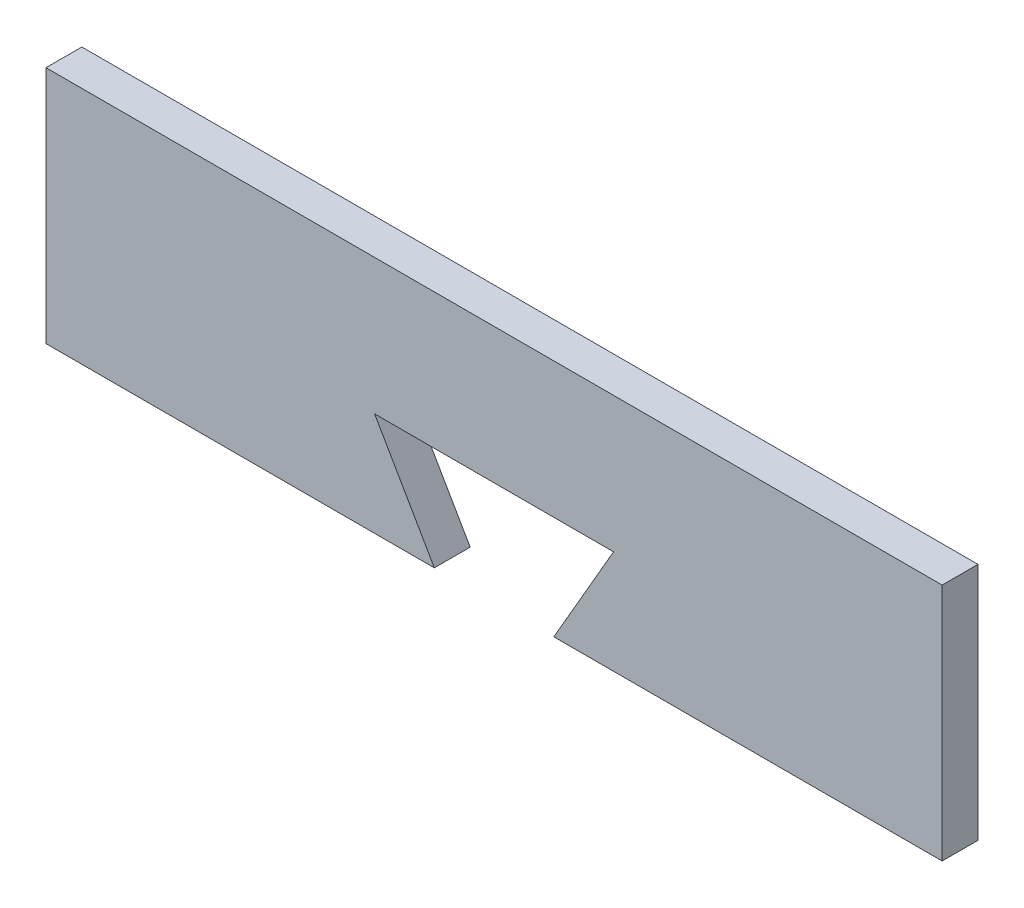
ISO-10303-21;
HEADER;
FILE_DESCRIPTION(('STEP AP214'),'2;1');
FILE_NAME('part.step','',(''),(''),'','','');
FILE_SCHEMA(('AUTOMOTIVE_DESIGN { 1 0 10303 214 1 1 1 1 }'));
ENDSEC;
DATA;
#1=APPLICATION_CONTEXT('core data for automotive mechanical design processes');
#2=APPLICATION_PROTOCOL_DEFINITION('international standard','automotive_design',2000,#1);
#3=PRODUCT_CONTEXT('',#1,'mechanical');
#4=PRODUCT('Part','Part','',(#3));
#5=PRODUCT_RELATED_PRODUCT_CATEGORY('part','',(#4));
#6=PRODUCT_DEFINITION_FORMATION('','',#4);
#7=PRODUCT_DEFINITION_CONTEXT('part definition',#1,'design');
#8=PRODUCT_DEFINITION('design','',#6,#7);
#9=PRODUCT_DEFINITION_SHAPE('','',#8);
#10=(LENGTH_UNIT() NAMED_UNIT(*) SI_UNIT(.MILLI.,.METRE.));
#11=(NAMED_UNIT(*) PLANE_ANGLE_UNIT() SI_UNIT($,.RADIAN.));
#12=(NAMED_UNIT(*) SI_UNIT($,.STERADIAN.) SOLID_ANGLE_UNIT());
#13=UNCERTAINTY_MEASURE_WITH_UNIT(LENGTH_MEASURE(1.E-05),#10,'distance_accuracy_value','');
#14=(GEOMETRIC_REPRESENTATION_CONTEXT(3) GLOBAL_UNCERTAINTY_ASSIGNED_CONTEXT((#13)) GLOBAL_UNIT_ASSIGNED_CONTEXT((#10,
#11,#12)) REPRESENTATION_CONTEXT('',''));
#15=CARTESIAN_POINT('',(0.,0.,0.));
#16=DIRECTION('',(0.,0.,1.));
#17=DIRECTION('',(1.,0.,0.));
#18=AXIS2_PLACEMENT_3D('',#15,#16,#17);
#19=CARTESIAN_POINT('',(-84.8349325818649,-10.8778625954199,6.));
#20=DIRECTION('',(1.,0.,0.));
#21=DIRECTION('',(0.,1.,0.));
#22=AXIS2_PLACEMENT_3D('',#19,#20,#21);
#23=PLANE('',#22);
#24=DIRECTION('',(0.,-1.,0.));
#25=VECTOR('',#24,1.);
#26=CARTESIAN_POINT('',(-84.8349325818649,-10.8778625954199,0.));
#27=LINE('',#26,#25);
#28=CARTESIAN_POINT('',(-84.8349325818649,29.1221374045802,0.));
#29=VERTEX_POINT('',#28);
#30=CARTESIAN_POINT('',(-84.8349325818649,-10.8778625954199,0.));
#31=VERTEX_POINT('',#30);
#32=EDGE_CURVE('E128',#29,#31,#27,.T.);
#33=ORIENTED_EDGE('',*,*,#32,.T.);
#34=DIRECTION('',(0.,0.,-1.));
#35=VECTOR('',#34,1.);
#36=CARTESIAN_POINT('',(-84.8349325818649,-10.8778625954199,6.));
#37=LINE('',#36,#35);
#38=CARTESIAN_POINT('',(-84.8349325818649,-10.8778625954199,6.));
#39=VERTEX_POINT('',#38);
#40=EDGE_CURVE('E11',#39,#31,#37,.T.);
#41=ORIENTED_EDGE('',*,*,#40,.F.);
#42=DIRECTION('',(0.,-1.,0.));
#43=VECTOR('',#42,1.);
#44=CARTESIAN_POINT('',(-84.8349325818649,-10.8778625954199,6.));
#45=LINE('',#44,#43);
#46=CARTESIAN_POINT('',(-84.8349325818649,29.1221374045802,6.));
#47=VERTEX_POINT('',#46);
#48=EDGE_CURVE('E142',#47,#39,#45,.T.);
#49=ORIENTED_EDGE('',*,*,#48,.F.);
#50=DIRECTION('',(0.,0.,-1.));
#51=VECTOR('',#50,1.);
#52=CARTESIAN_POINT('',(-84.8349325818649,29.1221374045802,6.));
#53=LINE('',#52,#51);
#54=EDGE_CURVE('E124',#47,#29,#53,.T.);
#55=ORIENTED_EDGE('',*,*,#54,.T.);
#56=EDGE_LOOP('',(#33,#41,#49,#55));
#57=FACE_BOUND('',#56,.T.);
#58=ADVANCED_FACE('F32',(#57),#23,.F.);
#59=CARTESIAN_POINT('',(-19.8349325818649,-10.8778625954198,6.));
#60=DIRECTION('',(0.,1.,0.));
#61=DIRECTION('',(-1.,0.,0.));
#62=AXIS2_PLACEMENT_3D('',#59,#60,#61);
#63=PLANE('',#62);
#64=DIRECTION('',(1.,0.,0.));
#65=VECTOR('',#64,1.);
#66=CARTESIAN_POINT('',(-19.8349325818649,-10.8778625954198,0.));
#67=LINE('',#66,#65);
#68=CARTESIAN_POINT('',(-19.8349325818649,-10.8778625954198,0.));
#69=VERTEX_POINT('',#68);
#70=EDGE_CURVE('E131',#31,#69,#67,.T.);
#71=ORIENTED_EDGE('',*,*,#70,.T.);
#72=DIRECTION('',(0.,0.,-1.));
#73=VECTOR('',#72,1.);
#74=CARTESIAN_POINT('',(-19.8349325818649,-10.8778625954198,6.));
#75=LINE('',#74,#73);
#76=CARTESIAN_POINT('',(-19.8349325818649,-10.8778625954198,6.));
#77=VERTEX_POINT('',#76);
#78=EDGE_CURVE('E40',#77,#69,#75,.T.);
#79=ORIENTED_EDGE('',*,*,#78,.F.);
#80=DIRECTION('',(1.,0.,0.));
#81=VECTOR('',#80,1.);
#82=CARTESIAN_POINT('',(-19.8349325818649,-10.8778625954198,6.));
#83=LINE('',#82,#81);
#84=EDGE_CURVE('E91',#39,#77,#83,.T.);
#85=ORIENTED_EDGE('',*,*,#84,.F.);
#86=ORIENTED_EDGE('',*,*,#40,.T.);
#87=EDGE_LOOP('',(#71,#79,#85,#86));
#88=FACE_BOUND('',#87,.T.);
#89=ADVANCED_FACE('F177',(#88),#63,.F.);
#90=CARTESIAN_POINT('',(-29.8349325818649,6.44264548026892,6.));
#91=DIRECTION('',(-0.866025403784438,-0.500000000000001,0.));
#92=DIRECTION('',(0.500000000000001,-0.866025403784438,0.));
#93=AXIS2_PLACEMENT_3D('',#90,#91,#92);
#94=PLANE('',#93);
#95=DIRECTION('',(-0.500000000000001,0.866025403784438,0.));
#96=VECTOR('',#95,1.);
#97=CARTESIAN_POINT('',(-29.8349325818649,6.44264548026892,0.));
#98=LINE('',#97,#96);
#99=CARTESIAN_POINT('',(-29.8349325818649,6.44264548026892,0.));
#100=VERTEX_POINT('',#99);
#101=EDGE_CURVE('E133',#69,#100,#98,.T.);
#102=ORIENTED_EDGE('',*,*,#101,.T.);
#103=DIRECTION('',(0.,0.,-1.));
#104=VECTOR('',#103,1.);
#105=CARTESIAN_POINT('',(-29.8349325818649,6.44264548026892,6.));
#106=LINE('',#105,#104);
#107=CARTESIAN_POINT('',(-29.8349325818649,6.44264548026892,6.));
#108=VERTEX_POINT('',#107);
#109=EDGE_CURVE('E149',#108,#100,#106,.T.);
#110=ORIENTED_EDGE('',*,*,#109,.F.);
#111=DIRECTION('',(-0.500000000000001,0.866025403784438,0.));
#112=VECTOR('',#111,1.);
#113=CARTESIAN_POINT('',(-29.8349325818649,6.44264548026892,6.));
#114=LINE('',#113,#112);
#115=EDGE_CURVE('E157',#77,#108,#114,.T.);
#116=ORIENTED_EDGE('',*,*,#115,.F.);
#117=ORIENTED_EDGE('',*,*,#78,.T.);
#118=EDGE_LOOP('',(#102,#110,#116,#117));
#119=FACE_BOUND('',#118,.T.);
#120=ADVANCED_FACE('F155',(#119),#94,.F.);
#121=CARTESIAN_POINT('',(10.1650674181351,6.44264548026893,6.));
#122=DIRECTION('',(0.,1.,0.));
#123=DIRECTION('',(-1.,0.,0.));
#124=AXIS2_PLACEMENT_3D('',#121,#122,#123);
#125=PLANE('',#124);
#126=DIRECTION('',(1.,0.,0.));
#127=VECTOR('',#126,1.);
#128=CARTESIAN_POINT('',(10.1650674181351,6.44264548026893,0.));
#129=LINE('',#128,#127);
#130=CARTESIAN_POINT('',(10.1650674181351,6.44264548026893,0.));
#131=VERTEX_POINT('',#130);
#132=EDGE_CURVE('E135',#100,#131,#129,.T.);
#133=ORIENTED_EDGE('',*,*,#132,.T.);
#134=DIRECTION('',(0.,0.,-1.));
#135=VECTOR('',#134,1.);
#136=CARTESIAN_POINT('',(10.1650674181351,6.44264548026893,6.));
#137=LINE('',#136,#135);
#138=CARTESIAN_POINT('',(10.1650674181351,6.44264548026893,6.));
#139=VERTEX_POINT('',#138);
#140=EDGE_CURVE('E146',#139,#131,#137,.T.);
#141=ORIENTED_EDGE('',*,*,#140,.F.);
#142=DIRECTION('',(1.,0.,0.));
#143=VECTOR('',#142,1.);
#144=CARTESIAN_POINT('',(10.1650674181351,6.44264548026893,6.));
#145=LINE('',#144,#143);
#146=EDGE_CURVE('E169',#108,#139,#145,.T.);
#147=ORIENTED_EDGE('',*,*,#146,.F.);
#148=ORIENTED_EDGE('',*,*,#109,.T.);
#149=EDGE_LOOP('',(#133,#141,#147,#148));
#150=FACE_BOUND('',#149,.T.);
#151=ADVANCED_FACE('F165',(#150),#125,.F.);
#152=CARTESIAN_POINT('',(0.165067418135101,-10.8778625954199,6.));
#153=DIRECTION('',(0.866025403784439,-0.499999999999999,0.));
#154=DIRECTION('',(0.499999999999999,0.866025403784439,0.));
#155=AXIS2_PLACEMENT_3D('',#152,#153,#154);
#156=PLANE('',#155);
#157=DIRECTION('',(-0.499999999999999,-0.866025403784439,0.));
#158=VECTOR('',#157,1.);
#159=CARTESIAN_POINT('',(0.165067418135101,-10.8778625954199,0.));
#160=LINE('',#159,#158);
#161=CARTESIAN_POINT('',(0.165067418135101,-10.8778625954199,0.));
#162=VERTEX_POINT('',#161);
#163=EDGE_CURVE('E137',#131,#162,#160,.T.);
#164=ORIENTED_EDGE('',*,*,#163,.T.);
#165=DIRECTION('',(0.,0.,-1.));
#166=VECTOR('',#165,1.);
#167=CARTESIAN_POINT('',(0.165067418135101,-10.8778625954199,6.));
#168=LINE('',#167,#166);
#169=CARTESIAN_POINT('',(0.165067418135101,-10.8778625954199,6.));
#170=VERTEX_POINT('',#169);
#171=EDGE_CURVE('E119',#170,#162,#168,.T.);
#172=ORIENTED_EDGE('',*,*,#171,.F.);
#173=DIRECTION('',(-0.499999999999999,-0.866025403784439,0.));
#174=VECTOR('',#173,1.);
#175=CARTESIAN_POINT('',(0.165067418135101,-10.8778625954199,6.));
#176=LINE('',#175,#174);
#177=EDGE_CURVE('E110',#139,#170,#176,.T.);
#178=ORIENTED_EDGE('',*,*,#177,.F.);
#179=ORIENTED_EDGE('',*,*,#140,.T.);
#180=EDGE_LOOP('',(#164,#172,#178,#179));
#181=FACE_BOUND('',#180,.T.);
#182=ADVANCED_FACE('F168',(#181),#156,.F.);
#183=CARTESIAN_POINT('',(65.1650674181351,-10.8778625954198,6.));
#184=DIRECTION('',(0.,1.,0.));
#185=DIRECTION('',(-1.,0.,0.));
#186=AXIS2_PLACEMENT_3D('',#183,#184,#185);
#187=PLANE('',#186);
#188=DIRECTION('',(1.,0.,0.));
#189=VECTOR('',#188,1.);
#190=CARTESIAN_POINT('',(65.1650674181351,-10.8778625954198,0.));
#191=LINE('',#190,#189);
#192=CARTESIAN_POINT('',(65.1650674181351,-10.8778625954198,0.));
#193=VERTEX_POINT('',#192);
#194=EDGE_CURVE('E118',#162,#193,#191,.T.);
#195=ORIENTED_EDGE('',*,*,#194,.T.);
#196=DIRECTION('',(0.,0.,-1.));
#197=VECTOR('',#196,1.);
#198=CARTESIAN_POINT('',(65.1650674181351,-10.8778625954198,6.));
#199=LINE('',#198,#197);
#200=CARTESIAN_POINT('',(65.1650674181351,-10.8778625954198,6.));
#201=VERTEX_POINT('',#200);
#202=EDGE_CURVE('E115',#201,#193,#199,.T.);
#203=ORIENTED_EDGE('',*,*,#202,.F.);
#204=DIRECTION('',(1.,0.,0.));
#205=VECTOR('',#204,1.);
#206=CARTESIAN_POINT('',(65.1650674181351,-10.8778625954198,6.));
#207=LINE('',#206,#205);
#208=EDGE_CURVE('E104',#170,#201,#207,.T.);
#209=ORIENTED_EDGE('',*,*,#208,.F.);
#210=ORIENTED_EDGE('',*,*,#171,.T.);
#211=EDGE_LOOP('',(#195,#203,#209,#210));
#212=FACE_BOUND('',#211,.T.);
#213=ADVANCED_FACE('F116',(#212),#187,.F.);
#214=CARTESIAN_POINT('',(65.1650674181351,29.1221374045802,6.));
#215=DIRECTION('',(-1.,0.,0.));
#216=DIRECTION('',(0.,0.,1.));
#217=AXIS2_PLACEMENT_3D('',#214,#215,#216);
#218=PLANE('',#217);
#219=DIRECTION('',(0.,1.,0.));
#220=VECTOR('',#219,1.);
#221=CARTESIAN_POINT('',(65.1650674181351,29.1221374045802,0.));
#222=LINE('',#221,#220);
#223=CARTESIAN_POINT('',(65.1650674181351,29.1221374045802,0.));
#224=VERTEX_POINT('',#223);
#225=EDGE_CURVE('E77',#193,#224,#222,.T.);
#226=ORIENTED_EDGE('',*,*,#225,.T.);
#227=DIRECTION('',(0.,0.,-1.));
#228=VECTOR('',#227,1.);
#229=CARTESIAN_POINT('',(65.1650674181351,29.1221374045802,6.));
#230=LINE('',#229,#228);
#231=CARTESIAN_POINT('',(65.1650674181351,29.1221374045802,6.));
#232=VERTEX_POINT('',#231);
#233=EDGE_CURVE('E120',#232,#224,#230,.T.);
#234=ORIENTED_EDGE('',*,*,#233,.F.);
#235=DIRECTION('',(0.,1.,0.));
#236=VECTOR('',#235,1.);
#237=CARTESIAN_POINT('',(65.1650674181351,29.1221374045802,6.));
#238=LINE('',#237,#236);
#239=EDGE_CURVE('E108',#201,#232,#238,.T.);
#240=ORIENTED_EDGE('',*,*,#239,.F.);
#241=ORIENTED_EDGE('',*,*,#202,.T.);
#242=EDGE_LOOP('',(#226,#234,#240,#241));
#243=FACE_BOUND('',#242,.T.);
#244=ADVANCED_FACE('F122',(#243),#218,.F.);
#245=CARTESIAN_POINT('',(-84.8349325818649,29.1221374045802,6.));
#246=DIRECTION('',(0.,-1.,0.));
#247=DIRECTION('',(0.,0.,-1.));
#248=AXIS2_PLACEMENT_3D('',#245,#246,#247);
#249=PLANE('',#248);
#250=DIRECTION('',(-1.,0.,0.));
#251=VECTOR('',#250,1.);
#252=CARTESIAN_POINT('',(-84.8349325818649,29.1221374045802,0.));
#253=LINE('',#252,#251);
#254=EDGE_CURVE('E83',#224,#29,#253,.T.);
#255=ORIENTED_EDGE('',*,*,#254,.T.);
#256=ORIENTED_EDGE('',*,*,#54,.F.);
#257=DIRECTION('',(-1.,0.,0.));
#258=VECTOR('',#257,1.);
#259=CARTESIAN_POINT('',(-84.8349325818649,29.1221374045802,6.));
#260=LINE('',#259,#258);
#261=EDGE_CURVE('E48',#232,#47,#260,.T.);
#262=ORIENTED_EDGE('',*,*,#261,.F.);
#263=ORIENTED_EDGE('',*,*,#233,.T.);
#264=EDGE_LOOP('',(#255,#256,#262,#263));
#265=FACE_BOUND('',#264,.T.);
#266=ADVANCED_FACE('F193',(#265),#249,.F.);
#267=CARTESIAN_POINT('',(0.,0.,6.));
#268=DIRECTION('',(0.,0.,-1.));
#269=DIRECTION('',(-1.,0.,0.));
#270=AXIS2_PLACEMENT_3D('',#267,#268,#269);
#271=PLANE('',#270);
#272=ORIENTED_EDGE('',*,*,#48,.T.);
#273=ORIENTED_EDGE('',*,*,#84,.T.);
#274=ORIENTED_EDGE('',*,*,#115,.T.);
#275=ORIENTED_EDGE('',*,*,#146,.T.);
#276=ORIENTED_EDGE('',*,*,#177,.T.);
#277=ORIENTED_EDGE('',*,*,#208,.T.);
#278=ORIENTED_EDGE('',*,*,#239,.T.);
#279=ORIENTED_EDGE('',*,*,#261,.T.);
#280=EDGE_LOOP('',(#272,#273,#274,#275,#276,#277,#278,#279));
#281=FACE_BOUND('',#280,.T.);
#282=ADVANCED_FACE('F106',(#281),#271,.F.);
#283=CARTESIAN_POINT('',(0.,0.,0.));
#284=DIRECTION('',(0.,0.,-1.));
#285=DIRECTION('',(-1.,0.,0.));
#286=AXIS2_PLACEMENT_3D('',#283,#284,#285);
#287=PLANE('',#286);
#288=ORIENTED_EDGE('',*,*,#32,.F.);
#289=ORIENTED_EDGE('',*,*,#254,.F.);
#290=ORIENTED_EDGE('',*,*,#225,.F.);
#291=ORIENTED_EDGE('',*,*,#194,.F.);
#292=ORIENTED_EDGE('',*,*,#163,.F.);
#293=ORIENTED_EDGE('',*,*,#132,.F.);
#294=ORIENTED_EDGE('',*,*,#101,.F.);
#295=ORIENTED_EDGE('',*,*,#70,.F.);
#296=EDGE_LOOP('',(#288,#289,#290,#291,#292,#293,#294,#295));
#297=FACE_BOUND('',#296,.T.);
#298=ADVANCED_FACE('F161',(#297),#287,.T.);
#299=CLOSED_SHELL('',(#58,#89,#120,#151,#182,#213,#244,#266,#282,#298));
#300=MANIFOLD_SOLID_BREP('B2',#299);
#301=ADVANCED_BREP_SHAPE_REPRESENTATION('',(#18,#300),#14);
#302=SHAPE_DEFINITION_REPRESENTATION(#9,#301);
ENDSEC;
END-ISO-10303-21;
